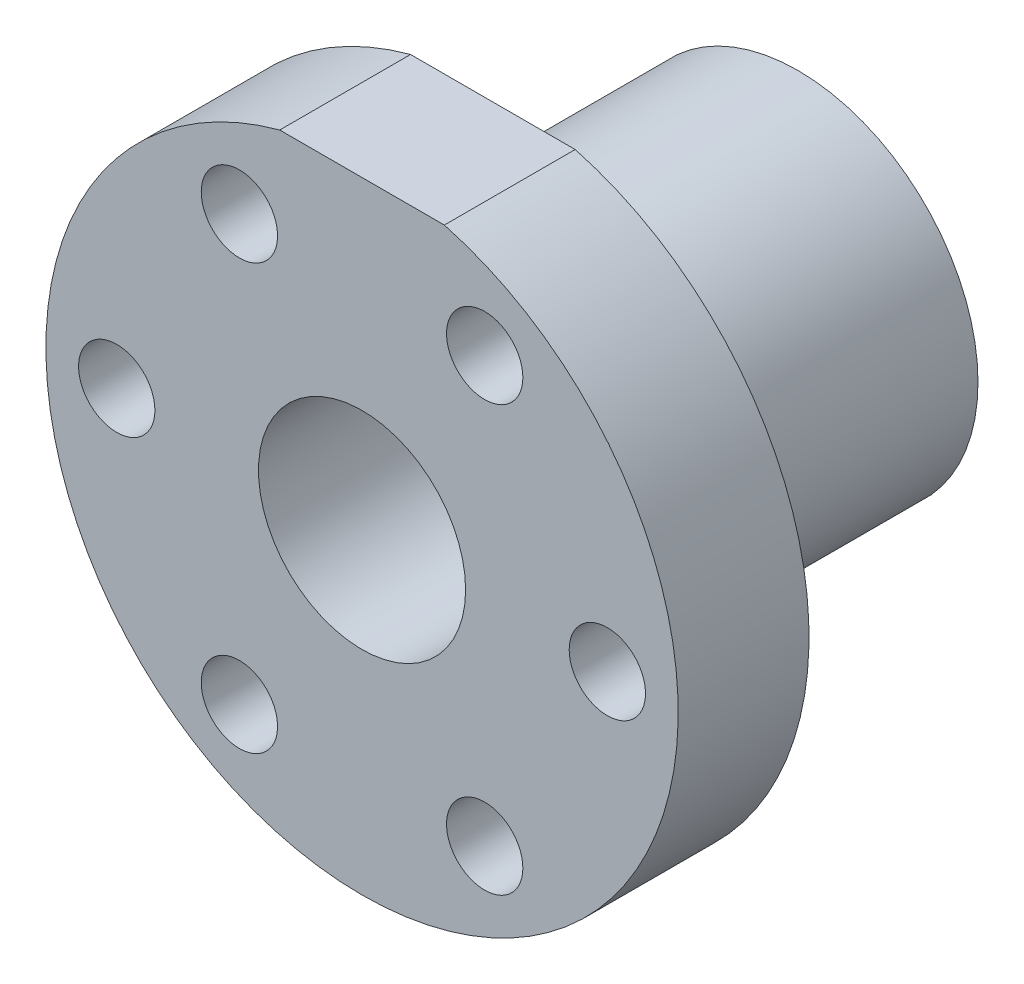
ISO-10303-21;
HEADER;
FILE_DESCRIPTION(('STEP AP214'),'2;1');
FILE_NAME('part.step','',(''),(''),'','','');
FILE_SCHEMA(('AUTOMOTIVE_DESIGN { 1 0 10303 214 1 1 1 1 }'));
ENDSEC;
DATA;
#1=APPLICATION_CONTEXT('core data for automotive mechanical design processes');
#2=APPLICATION_PROTOCOL_DEFINITION('international standard','automotive_design',2000,#1);
#3=PRODUCT_CONTEXT('',#1,'mechanical');
#4=PRODUCT('Part','Part','',(#3));
#5=PRODUCT_RELATED_PRODUCT_CATEGORY('part','',(#4));
#6=PRODUCT_DEFINITION_FORMATION('','',#4);
#7=PRODUCT_DEFINITION_CONTEXT('part definition',#1,'design');
#8=PRODUCT_DEFINITION('design','',#6,#7);
#9=PRODUCT_DEFINITION_SHAPE('','',#8);
#10=(LENGTH_UNIT() NAMED_UNIT(*) SI_UNIT(.MILLI.,.METRE.));
#11=(NAMED_UNIT(*) PLANE_ANGLE_UNIT() SI_UNIT($,.RADIAN.));
#12=(NAMED_UNIT(*) SI_UNIT($,.STERADIAN.) SOLID_ANGLE_UNIT());
#13=UNCERTAINTY_MEASURE_WITH_UNIT(LENGTH_MEASURE(1.E-05),#10,'distance_accuracy_value','');
#14=(GEOMETRIC_REPRESENTATION_CONTEXT(3) GLOBAL_UNCERTAINTY_ASSIGNED_CONTEXT((#13)) GLOBAL_UNIT_ASSIGNED_CONTEXT((#10,
#11,#12)) REPRESENTATION_CONTEXT('',''));
#15=CARTESIAN_POINT('',(0.,0.,0.));
#16=DIRECTION('',(0.,0.,1.));
#17=DIRECTION('',(1.,0.,0.));
#18=AXIS2_PLACEMENT_3D('',#15,#16,#17);
#19=CARTESIAN_POINT('',(0.,0.,28.));
#20=DIRECTION('',(0.,0.,-1.));
#21=DIRECTION('',(-1.,0.,0.));
#22=AXIS2_PLACEMENT_3D('',#19,#20,#21);
#23=CYLINDRICAL_SURFACE('',#22,16.5);
#24=CARTESIAN_POINT('',(0.,0.,28.));
#25=DIRECTION('',(0.,0.,1.));
#26=DIRECTION('',(1.,0.,0.));
#27=AXIS2_PLACEMENT_3D('',#24,#25,#26);
#28=CIRCLE('',#27,16.5);
#29=CARTESIAN_POINT('',(16.5,0.,28.));
#30=VERTEX_POINT('',#29);
#31=EDGE_CURVE('E40',#30,#30,#28,.T.);
#32=ORIENTED_EDGE('',*,*,#31,.F.);
#33=EDGE_LOOP('',(#32));
#34=FACE_BOUND('',#33,.T.);
#35=CARTESIAN_POINT('',(0.,0.,0.));
#36=DIRECTION('',(0.,0.,1.));
#37=DIRECTION('',(1.,0.,0.));
#38=AXIS2_PLACEMENT_3D('',#35,#36,#37);
#39=CIRCLE('',#38,16.5);
#40=CARTESIAN_POINT('',(16.5,0.,0.));
#41=VERTEX_POINT('',#40);
#42=EDGE_CURVE('E72',#41,#41,#39,.T.);
#43=ORIENTED_EDGE('',*,*,#42,.T.);
#44=EDGE_LOOP('',(#43));
#45=FACE_BOUND('',#44,.T.);
#46=ADVANCED_FACE('F33',(#34,#45),#23,.T.);
#47=CARTESIAN_POINT('',(0.,0.,0.));
#48=DIRECTION('',(0.,0.,1.));
#49=DIRECTION('',(1.,0.,0.));
#50=AXIS2_PLACEMENT_3D('',#47,#48,#49);
#51=PLANE('',#50);
#52=CARTESIAN_POINT('',(0.,0.,0.));
#53=DIRECTION('',(0.,0.,1.));
#54=DIRECTION('',(1.,0.,0.));
#55=AXIS2_PLACEMENT_3D('',#52,#53,#54);
#56=CIRCLE('',#55,9.5);
#57=CARTESIAN_POINT('',(9.5,0.,0.));
#58=VERTEX_POINT('',#57);
#59=EDGE_CURVE('E76',#58,#58,#56,.T.);
#60=ORIENTED_EDGE('',*,*,#59,.T.);
#61=EDGE_LOOP('',(#60));
#62=FACE_BOUND('',#61,.T.);
#63=ORIENTED_EDGE('',*,*,#42,.F.);
#64=EDGE_LOOP('',(#63));
#65=FACE_BOUND('',#64,.T.);
#66=ADVANCED_FACE('F89',(#62,#65),#51,.F.);
#67=CARTESIAN_POINT('',(0.,0.,40.));
#68=DIRECTION('',(0.,0.,-1.));
#69=DIRECTION('',(-1.,0.,0.));
#70=AXIS2_PLACEMENT_3D('',#67,#68,#69);
#71=CYLINDRICAL_SURFACE('',#70,29.);
#72=CARTESIAN_POINT('',(0.,0.,40.));
#73=DIRECTION('',(0.,0.,1.));
#74=DIRECTION('',(1.,0.,0.));
#75=AXIS2_PLACEMENT_3D('',#72,#73,#74);
#76=CIRCLE('',#75,29.);
#77=CARTESIAN_POINT('',(-7.54983443527075,28.,40.));
#78=VERTEX_POINT('',#77);
#79=CARTESIAN_POINT('',(7.54983443527075,28.,40.));
#80=VERTEX_POINT('',#79);
#81=EDGE_CURVE('E68',#78,#80,#76,.T.);
#82=ORIENTED_EDGE('',*,*,#81,.F.);
#83=DIRECTION('',(0.,0.,-1.));
#84=VECTOR('',#83,1.);
#85=CARTESIAN_POINT('',(-7.54983443527075,28.,40.));
#86=LINE('',#85,#84);
#87=CARTESIAN_POINT('',(-7.54983443527075,28.,28.));
#88=VERTEX_POINT('',#87);
#89=EDGE_CURVE('E54',#78,#88,#86,.T.);
#90=ORIENTED_EDGE('',*,*,#89,.T.);
#91=CARTESIAN_POINT('',(0.,0.,28.));
#92=DIRECTION('',(0.,0.,1.));
#93=DIRECTION('',(1.,0.,0.));
#94=AXIS2_PLACEMENT_3D('',#91,#92,#93);
#95=CIRCLE('',#94,29.);
#96=CARTESIAN_POINT('',(7.54983443527075,28.,28.));
#97=VERTEX_POINT('',#96);
#98=EDGE_CURVE('E73',#88,#97,#95,.T.);
#99=ORIENTED_EDGE('',*,*,#98,.T.);
#100=DIRECTION('',(0.,0.,-1.));
#101=VECTOR('',#100,1.);
#102=CARTESIAN_POINT('',(7.54983443527075,28.,40.));
#103=LINE('',#102,#101);
#104=EDGE_CURVE('E47',#97,#80,#103,.F.);
#105=ORIENTED_EDGE('',*,*,#104,.T.);
#106=EDGE_LOOP('',(#82,#90,#99,#105));
#107=FACE_BOUND('',#106,.T.);
#108=ADVANCED_FACE('F71',(#107),#71,.T.);
#109=CARTESIAN_POINT('',(0.,0.,40.));
#110=DIRECTION('',(0.,0.,1.));
#111=DIRECTION('',(1.,0.,0.));
#112=AXIS2_PLACEMENT_3D('',#109,#110,#111);
#113=PLANE('',#112);
#114=CARTESIAN_POINT('',(-11.2500000000002,19.4855715851497,40.));
#115=DIRECTION('',(0.,0.,1.));
#116=DIRECTION('',(0.50000000000001,-0.866025403784433,0.));
#117=AXIS2_PLACEMENT_3D('',#114,#115,#116);
#118=CIRCLE('',#117,3.5);
#119=CARTESIAN_POINT('',(-9.50000000000019,16.4544826719042,40.));
#120=VERTEX_POINT('',#119);
#121=EDGE_CURVE('E164',#120,#120,#118,.T.);
#122=ORIENTED_EDGE('',*,*,#121,.F.);
#123=EDGE_LOOP('',(#122));
#124=FACE_BOUND('',#123,.T.);
#125=CARTESIAN_POINT('',(11.2499999999998,19.48557158515,40.));
#126=DIRECTION('',(0.,0.,1.));
#127=DIRECTION('',(-0.499999999999992,-0.866025403784443,0.));
#128=AXIS2_PLACEMENT_3D('',#125,#126,#127);
#129=CIRCLE('',#128,3.5);
#130=CARTESIAN_POINT('',(9.49999999999985,16.4544826719044,40.));
#131=VERTEX_POINT('',#130);
#132=EDGE_CURVE('E158',#131,#131,#129,.T.);
#133=ORIENTED_EDGE('',*,*,#132,.F.);
#134=EDGE_LOOP('',(#133));
#135=FACE_BOUND('',#134,.T.);
#136=CARTESIAN_POINT('',(22.5,0.,40.));
#137=DIRECTION('',(0.,0.,1.));
#138=DIRECTION('',(-1.,0.,0.));
#139=AXIS2_PLACEMENT_3D('',#136,#137,#138);
#140=CIRCLE('',#139,3.5);
#141=CARTESIAN_POINT('',(19.,0.,40.));
#142=VERTEX_POINT('',#141);
#143=EDGE_CURVE('E150',#142,#142,#140,.T.);
#144=ORIENTED_EDGE('',*,*,#143,.F.);
#145=EDGE_LOOP('',(#144));
#146=FACE_BOUND('',#145,.T.);
#147=CARTESIAN_POINT('',(11.2500000000001,-19.4855715851498,40.));
#148=DIRECTION('',(0.,0.,1.));
#149=DIRECTION('',(-0.500000000000004,0.866025403784436,0.));
#150=AXIS2_PLACEMENT_3D('',#147,#148,#149);
#151=CIRCLE('',#150,3.5);
#152=CARTESIAN_POINT('',(9.50000000000008,-16.4544826719043,40.));
#153=VERTEX_POINT('',#152);
#154=EDGE_CURVE('E143',#153,#153,#151,.T.);
#155=ORIENTED_EDGE('',*,*,#154,.F.);
#156=EDGE_LOOP('',(#155));
#157=FACE_BOUND('',#156,.T.);
#158=CARTESIAN_POINT('',(-11.25,-19.4855715851499,40.));
#159=DIRECTION('',(0.,0.,1.));
#160=DIRECTION('',(0.499999999999998,0.86602540378444,0.));
#161=AXIS2_PLACEMENT_3D('',#158,#159,#160);
#162=CIRCLE('',#161,3.5);
#163=CARTESIAN_POINT('',(-9.49999999999996,-16.4544826719044,40.));
#164=VERTEX_POINT('',#163);
#165=EDGE_CURVE('E147',#164,#164,#162,.T.);
#166=ORIENTED_EDGE('',*,*,#165,.F.);
#167=EDGE_LOOP('',(#166));
#168=FACE_BOUND('',#167,.T.);
#169=CARTESIAN_POINT('',(-22.5,0.,40.));
#170=DIRECTION('',(0.,0.,1.));
#171=DIRECTION('',(1.,0.,0.));
#172=AXIS2_PLACEMENT_3D('',#169,#170,#171);
#173=CIRCLE('',#172,3.5);
#174=CARTESIAN_POINT('',(-19.,0.,40.));
#175=VERTEX_POINT('',#174);
#176=EDGE_CURVE('E170',#175,#175,#173,.T.);
#177=ORIENTED_EDGE('',*,*,#176,.F.);
#178=EDGE_LOOP('',(#177));
#179=FACE_BOUND('',#178,.T.);
#180=DIRECTION('',(1.,0.,0.));
#181=VECTOR('',#180,1.);
#182=CARTESIAN_POINT('',(-17.4822164041406,28.,40.));
#183=LINE('',#182,#181);
#184=EDGE_CURVE('E57',#78,#80,#183,.T.);
#185=ORIENTED_EDGE('',*,*,#184,.F.);
#186=ORIENTED_EDGE('',*,*,#81,.T.);
#187=EDGE_LOOP('',(#185,#186));
#188=FACE_BOUND('',#187,.T.);
#189=CARTESIAN_POINT('',(0.,0.,40.));
#190=DIRECTION('',(0.,0.,1.));
#191=DIRECTION('',(1.,0.,0.));
#192=AXIS2_PLACEMENT_3D('',#189,#190,#191);
#193=CIRCLE('',#192,9.5);
#194=CARTESIAN_POINT('',(9.5,0.,40.));
#195=VERTEX_POINT('',#194);
#196=EDGE_CURVE('E62',#195,#195,#193,.T.);
#197=ORIENTED_EDGE('',*,*,#196,.F.);
#198=EDGE_LOOP('',(#197));
#199=FACE_BOUND('',#198,.T.);
#200=ADVANCED_FACE('F66',(#124,#135,#146,#157,#168,#179,#188,#199),#113,.T.);
#201=CARTESIAN_POINT('',(0.,0.,28.));
#202=DIRECTION('',(0.,0.,1.));
#203=DIRECTION('',(1.,0.,0.));
#204=AXIS2_PLACEMENT_3D('',#201,#202,#203);
#205=PLANE('',#204);
#206=CARTESIAN_POINT('',(-11.2500000000002,19.4855715851497,28.));
#207=DIRECTION('',(0.,0.,1.));
#208=DIRECTION('',(0.50000000000001,-0.866025403784433,0.));
#209=AXIS2_PLACEMENT_3D('',#206,#207,#208);
#210=CIRCLE('',#209,3.5);
#211=CARTESIAN_POINT('',(-9.50000000000019,16.4544826719042,28.));
#212=VERTEX_POINT('',#211);
#213=EDGE_CURVE('E161',#212,#212,#210,.T.);
#214=ORIENTED_EDGE('',*,*,#213,.T.);
#215=EDGE_LOOP('',(#214));
#216=FACE_BOUND('',#215,.T.);
#217=CARTESIAN_POINT('',(11.2499999999998,19.48557158515,28.));
#218=DIRECTION('',(0.,0.,1.));
#219=DIRECTION('',(-0.499999999999992,-0.866025403784443,0.));
#220=AXIS2_PLACEMENT_3D('',#217,#218,#219);
#221=CIRCLE('',#220,3.5);
#222=CARTESIAN_POINT('',(9.49999999999985,16.4544826719044,28.));
#223=VERTEX_POINT('',#222);
#224=EDGE_CURVE('E155',#223,#223,#221,.T.);
#225=ORIENTED_EDGE('',*,*,#224,.T.);
#226=EDGE_LOOP('',(#225));
#227=FACE_BOUND('',#226,.T.);
#228=CARTESIAN_POINT('',(22.5,0.,28.));
#229=DIRECTION('',(0.,0.,1.));
#230=DIRECTION('',(-1.,0.,0.));
#231=AXIS2_PLACEMENT_3D('',#228,#229,#230);
#232=CIRCLE('',#231,3.5);
#233=CARTESIAN_POINT('',(19.,0.,28.));
#234=VERTEX_POINT('',#233);
#235=EDGE_CURVE('E145',#234,#234,#232,.T.);
#236=ORIENTED_EDGE('',*,*,#235,.T.);
#237=EDGE_LOOP('',(#236));
#238=FACE_BOUND('',#237,.T.);
#239=CARTESIAN_POINT('',(11.2500000000001,-19.4855715851498,28.));
#240=DIRECTION('',(0.,0.,1.));
#241=DIRECTION('',(-0.500000000000004,0.866025403784436,0.));
#242=AXIS2_PLACEMENT_3D('',#239,#240,#241);
#243=CIRCLE('',#242,3.5);
#244=CARTESIAN_POINT('',(9.50000000000008,-16.4544826719043,28.));
#245=VERTEX_POINT('',#244);
#246=EDGE_CURVE('E140',#245,#245,#243,.T.);
#247=ORIENTED_EDGE('',*,*,#246,.T.);
#248=EDGE_LOOP('',(#247));
#249=FACE_BOUND('',#248,.T.);
#250=CARTESIAN_POINT('',(-11.25,-19.4855715851499,28.));
#251=DIRECTION('',(0.,0.,1.));
#252=DIRECTION('',(0.499999999999998,0.86602540378444,0.));
#253=AXIS2_PLACEMENT_3D('',#250,#251,#252);
#254=CIRCLE('',#253,3.5);
#255=CARTESIAN_POINT('',(-9.49999999999996,-16.4544826719044,28.));
#256=VERTEX_POINT('',#255);
#257=EDGE_CURVE('E167',#256,#256,#254,.T.);
#258=ORIENTED_EDGE('',*,*,#257,.T.);
#259=EDGE_LOOP('',(#258));
#260=FACE_BOUND('',#259,.T.);
#261=CARTESIAN_POINT('',(-22.5,0.,28.));
#262=DIRECTION('',(0.,0.,1.));
#263=DIRECTION('',(1.,0.,0.));
#264=AXIS2_PLACEMENT_3D('',#261,#262,#263);
#265=CIRCLE('',#264,3.5);
#266=CARTESIAN_POINT('',(-19.,0.,28.));
#267=VERTEX_POINT('',#266);
#268=EDGE_CURVE('E69',#267,#267,#265,.T.);
#269=ORIENTED_EDGE('',*,*,#268,.T.);
#270=EDGE_LOOP('',(#269));
#271=FACE_BOUND('',#270,.T.);
#272=ORIENTED_EDGE('',*,*,#31,.T.);
#273=EDGE_LOOP('',(#272));
#274=FACE_BOUND('',#273,.T.);
#275=ORIENTED_EDGE('',*,*,#98,.F.);
#276=DIRECTION('',(1.,0.,0.));
#277=VECTOR('',#276,1.);
#278=CARTESIAN_POINT('',(0.,28.,28.));
#279=LINE('',#278,#277);
#280=EDGE_CURVE('E11',#88,#97,#279,.T.);
#281=ORIENTED_EDGE('',*,*,#280,.T.);
#282=EDGE_LOOP('',(#275,#281));
#283=FACE_BOUND('',#282,.T.);
#284=ADVANCED_FACE('F84',(#216,#227,#238,#249,#260,#271,#274,#283),#205,.F.);
#285=CARTESIAN_POINT('',(0.,0.,0.));
#286=DIRECTION('',(0.,0.,1.));
#287=DIRECTION('',(1.,0.,0.));
#288=AXIS2_PLACEMENT_3D('',#285,#286,#287);
#289=CYLINDRICAL_SURFACE('',#288,9.5);
#290=ORIENTED_EDGE('',*,*,#59,.F.);
#291=EDGE_LOOP('',(#290));
#292=FACE_BOUND('',#291,.T.);
#293=ORIENTED_EDGE('',*,*,#196,.T.);
#294=EDGE_LOOP('',(#293));
#295=FACE_BOUND('',#294,.T.);
#296=ADVANCED_FACE('F102',(#292,#295),#289,.F.);
#297=CARTESIAN_POINT('',(-17.4822164041406,28.,28.));
#298=DIRECTION('',(0.,-1.,0.));
#299=DIRECTION('',(0.,0.,-1.));
#300=AXIS2_PLACEMENT_3D('',#297,#298,#299);
#301=PLANE('',#300);
#302=ORIENTED_EDGE('',*,*,#184,.T.);
#303=ORIENTED_EDGE('',*,*,#104,.F.);
#304=ORIENTED_EDGE('',*,*,#280,.F.);
#305=ORIENTED_EDGE('',*,*,#89,.F.);
#306=EDGE_LOOP('',(#302,#303,#304,#305));
#307=FACE_BOUND('',#306,.T.);
#308=ADVANCED_FACE('F56',(#307),#301,.F.);
#309=CARTESIAN_POINT('',(-22.5,0.,28.));
#310=DIRECTION('',(0.,0.,1.));
#311=DIRECTION('',(1.,0.,0.));
#312=AXIS2_PLACEMENT_3D('',#309,#310,#311);
#313=CYLINDRICAL_SURFACE('',#312,3.5);
#314=ORIENTED_EDGE('',*,*,#268,.F.);
#315=EDGE_LOOP('',(#314));
#316=FACE_BOUND('',#315,.T.);
#317=ORIENTED_EDGE('',*,*,#176,.T.);
#318=EDGE_LOOP('',(#317));
#319=FACE_BOUND('',#318,.T.);
#320=ADVANCED_FACE('F112',(#316,#319),#313,.F.);
#321=CARTESIAN_POINT('',(-11.25,-19.4855715851499,28.));
#322=DIRECTION('',(0.,0.,1.));
#323=DIRECTION('',(1.,0.,0.));
#324=AXIS2_PLACEMENT_3D('',#321,#322,#323);
#325=CYLINDRICAL_SURFACE('',#324,3.5);
#326=ORIENTED_EDGE('',*,*,#257,.F.);
#327=EDGE_LOOP('',(#326));
#328=FACE_BOUND('',#327,.T.);
#329=ORIENTED_EDGE('',*,*,#165,.T.);
#330=EDGE_LOOP('',(#329));
#331=FACE_BOUND('',#330,.T.);
#332=ADVANCED_FACE('F115',(#328,#331),#325,.F.);
#333=CARTESIAN_POINT('',(11.2500000000001,-19.4855715851498,28.));
#334=DIRECTION('',(0.,0.,1.));
#335=DIRECTION('',(1.,0.,0.));
#336=AXIS2_PLACEMENT_3D('',#333,#334,#335);
#337=CYLINDRICAL_SURFACE('',#336,3.5);
#338=ORIENTED_EDGE('',*,*,#246,.F.);
#339=EDGE_LOOP('',(#338));
#340=FACE_BOUND('',#339,.T.);
#341=ORIENTED_EDGE('',*,*,#154,.T.);
#342=EDGE_LOOP('',(#341));
#343=FACE_BOUND('',#342,.T.);
#344=ADVANCED_FACE('F119',(#340,#343),#337,.F.);
#345=CARTESIAN_POINT('',(22.5,0.,28.));
#346=DIRECTION('',(0.,0.,1.));
#347=DIRECTION('',(1.,0.,0.));
#348=AXIS2_PLACEMENT_3D('',#345,#346,#347);
#349=CYLINDRICAL_SURFACE('',#348,3.5);
#350=ORIENTED_EDGE('',*,*,#235,.F.);
#351=EDGE_LOOP('',(#350));
#352=FACE_BOUND('',#351,.T.);
#353=ORIENTED_EDGE('',*,*,#143,.T.);
#354=EDGE_LOOP('',(#353));
#355=FACE_BOUND('',#354,.T.);
#356=ADVANCED_FACE('F128',(#352,#355),#349,.F.);
#357=CARTESIAN_POINT('',(11.2499999999998,19.48557158515,28.));
#358=DIRECTION('',(0.,0.,1.));
#359=DIRECTION('',(1.,0.,0.));
#360=AXIS2_PLACEMENT_3D('',#357,#358,#359);
#361=CYLINDRICAL_SURFACE('',#360,3.5);
#362=ORIENTED_EDGE('',*,*,#224,.F.);
#363=EDGE_LOOP('',(#362));
#364=FACE_BOUND('',#363,.T.);
#365=ORIENTED_EDGE('',*,*,#132,.T.);
#366=EDGE_LOOP('',(#365));
#367=FACE_BOUND('',#366,.T.);
#368=ADVANCED_FACE('F124',(#364,#367),#361,.F.);
#369=CARTESIAN_POINT('',(-11.2500000000002,19.4855715851497,28.));
#370=DIRECTION('',(0.,0.,1.));
#371=DIRECTION('',(1.,0.,0.));
#372=AXIS2_PLACEMENT_3D('',#369,#370,#371);
#373=CYLINDRICAL_SURFACE('',#372,3.5);
#374=ORIENTED_EDGE('',*,*,#213,.F.);
#375=EDGE_LOOP('',(#374));
#376=FACE_BOUND('',#375,.T.);
#377=ORIENTED_EDGE('',*,*,#121,.T.);
#378=EDGE_LOOP('',(#377));
#379=FACE_BOUND('',#378,.T.);
#380=ADVANCED_FACE('F121',(#376,#379),#373,.F.);
#381=CLOSED_SHELL('',(#46,#66,#108,#200,#284,#296,#308,#320,#332,#344,#356,#368,#380));
#382=MANIFOLD_SOLID_BREP('B2',#381);
#383=ADVANCED_BREP_SHAPE_REPRESENTATION('',(#18,#382),#14);
#384=SHAPE_DEFINITION_REPRESENTATION(#9,#383);
ENDSEC;
END-ISO-10303-21;
